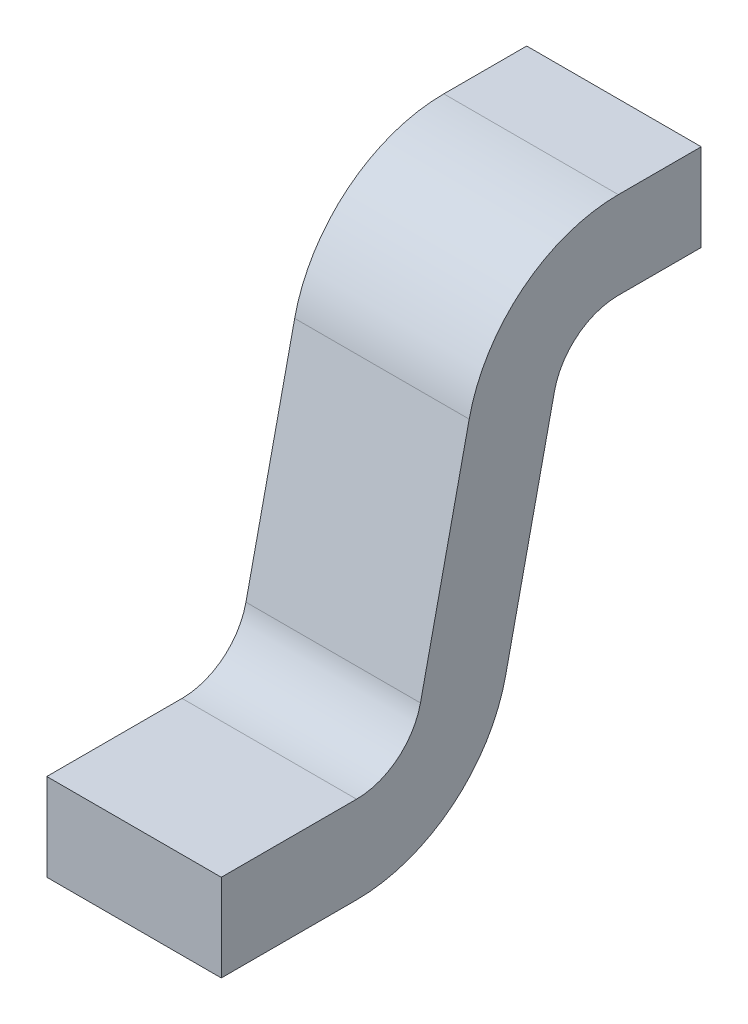
ISO-10303-21;
HEADER;
FILE_DESCRIPTION(('STEP AP214'),'2;1');
FILE_NAME('part.step','',(''),(''),'','','');
FILE_SCHEMA(('AUTOMOTIVE_DESIGN { 1 0 10303 214 1 1 1 1 }'));
ENDSEC;
DATA;
#1=APPLICATION_CONTEXT('core data for automotive mechanical design processes');
#2=APPLICATION_PROTOCOL_DEFINITION('international standard','automotive_design',2000,#1);
#3=PRODUCT_CONTEXT('',#1,'mechanical');
#4=PRODUCT('Part','Part','',(#3));
#5=PRODUCT_RELATED_PRODUCT_CATEGORY('part','',(#4));
#6=PRODUCT_DEFINITION_FORMATION('','',#4);
#7=PRODUCT_DEFINITION_CONTEXT('part definition',#1,'design');
#8=PRODUCT_DEFINITION('design','',#6,#7);
#9=PRODUCT_DEFINITION_SHAPE('','',#8);
#10=(LENGTH_UNIT() NAMED_UNIT(*) SI_UNIT(.MILLI.,.METRE.));
#11=(NAMED_UNIT(*) PLANE_ANGLE_UNIT() SI_UNIT($,.RADIAN.));
#12=(NAMED_UNIT(*) SI_UNIT($,.STERADIAN.) SOLID_ANGLE_UNIT());
#13=UNCERTAINTY_MEASURE_WITH_UNIT(LENGTH_MEASURE(1.E-05),#10,'distance_accuracy_value','');
#14=(GEOMETRIC_REPRESENTATION_CONTEXT(3) GLOBAL_UNCERTAINTY_ASSIGNED_CONTEXT((#13)) GLOBAL_UNIT_ASSIGNED_CONTEXT((#10,
#11,#12)) REPRESENTATION_CONTEXT('',''));
#15=CARTESIAN_POINT('',(0.,0.,0.));
#16=DIRECTION('',(0.,0.,1.));
#17=DIRECTION('',(1.,0.,0.));
#18=AXIS2_PLACEMENT_3D('',#15,#16,#17);
#19=CARTESIAN_POINT('',(-0.2,-0.25,0.19));
#20=DIRECTION('',(1.,0.,0.));
#21=DIRECTION('',(0.,0.,-1.));
#22=AXIS2_PLACEMENT_3D('',#19,#20,#21);
#23=PLANE('',#22);
#24=DIRECTION('',(0.,0.976627109439069,-0.214940664158015));
#25=VECTOR('',#24,1.);
#26=CARTESIAN_POINT('',(-0.2,-0.217758900376,0.336494066416));
#27=LINE('',#26,#25);
#28=CARTESIAN_POINT('',(-0.2,-0.725229232455129,0.448180511696269));
#29=VERTEX_POINT('',#28);
#30=CARTESIAN_POINT('',(-0.2,-0.217758900376149,0.33649406641593));
#31=VERTEX_POINT('',#30);
#32=EDGE_CURVE('E96',#29,#31,#27,.T.);
#33=ORIENTED_EDGE('',*,*,#32,.F.);
#34=CARTESIAN_POINT('',(-0.2,-0.65,0.79));
#35=DIRECTION('',(1.,0.,0.));
#36=DIRECTION('',(0.,0.,-1.));
#37=AXIS2_PLACEMENT_3D('',#34,#35,#36);
#38=CIRCLE('',#37,0.35);
#39=CARTESIAN_POINT('',(-0.2,-1.,0.79));
#40=VERTEX_POINT('',#39);
#41=EDGE_CURVE('E165',#40,#29,#38,.T.);
#42=ORIENTED_EDGE('',*,*,#41,.F.);
#43=DIRECTION('',(0.,0.,-1.));
#44=VECTOR('',#43,1.);
#45=CARTESIAN_POINT('',(-0.2,-1.,1.1));
#46=LINE('',#45,#44);
#47=CARTESIAN_POINT('',(-0.2,-1.,1.1));
#48=VERTEX_POINT('',#47);
#49=EDGE_CURVE('E118',#48,#40,#46,.T.);
#50=ORIENTED_EDGE('',*,*,#49,.F.);
#51=DIRECTION('',(0.,1.,0.));
#52=VECTOR('',#51,1.);
#53=CARTESIAN_POINT('',(-0.2,-1.,1.1));
#54=LINE('',#53,#52);
#55=CARTESIAN_POINT('',(-0.2,-0.8,1.1));
#56=VERTEX_POINT('',#55);
#57=EDGE_CURVE('E123',#48,#56,#54,.T.);
#58=ORIENTED_EDGE('',*,*,#57,.T.);
#59=DIRECTION('',(0.,0.,-1.));
#60=VECTOR('',#59,1.);
#61=CARTESIAN_POINT('',(-0.2,-0.8,1.1));
#62=LINE('',#61,#60);
#63=CARTESIAN_POINT('',(-0.2,-0.8,0.79));
#64=VERTEX_POINT('',#63);
#65=EDGE_CURVE('E130',#56,#64,#62,.T.);
#66=ORIENTED_EDGE('',*,*,#65,.T.);
#67=CARTESIAN_POINT('',(-0.2,-0.65,0.79));
#68=DIRECTION('',(1.,0.,0.));
#69=DIRECTION('',(0.,0.,-1.));
#70=AXIS2_PLACEMENT_3D('',#67,#68,#69);
#71=CIRCLE('',#70,0.15);
#72=CARTESIAN_POINT('',(-0.2,-0.682241099623828,0.643505933584176));
#73=VERTEX_POINT('',#72);
#74=EDGE_CURVE('E167',#64,#73,#71,.T.);
#75=ORIENTED_EDGE('',*,*,#74,.T.);
#76=DIRECTION('',(0.,0.976627109439069,-0.214940664158015));
#77=VECTOR('',#76,1.);
#78=CARTESIAN_POINT('',(-0.2,-0.174770767545,0.531819488304));
#79=LINE('',#78,#77);
#80=CARTESIAN_POINT('',(-0.2,-0.17477076754482,0.531819488303961));
#81=VERTEX_POINT('',#80);
#82=EDGE_CURVE('E135',#73,#81,#79,.T.);
#83=ORIENTED_EDGE('',*,*,#82,.T.);
#84=CARTESIAN_POINT('',(-0.2,-0.25,0.19));
#85=DIRECTION('',(1.,0.,0.));
#86=DIRECTION('',(0.,0.,-1.));
#87=AXIS2_PLACEMENT_3D('',#84,#85,#86);
#88=CIRCLE('',#87,0.35);
#89=CARTESIAN_POINT('',(-0.2,0.1,0.19));
#90=VERTEX_POINT('',#89);
#91=EDGE_CURVE('E138',#90,#81,#88,.T.);
#92=ORIENTED_EDGE('',*,*,#91,.F.);
#93=DIRECTION('',(0.,0.,-1.));
#94=VECTOR('',#93,1.);
#95=CARTESIAN_POINT('',(-0.2,0.1,0.19));
#96=LINE('',#95,#94);
#97=CARTESIAN_POINT('',(-0.2,0.1,0.));
#98=VERTEX_POINT('',#97);
#99=EDGE_CURVE('E139',#90,#98,#96,.T.);
#100=ORIENTED_EDGE('',*,*,#99,.T.);
#101=DIRECTION('',(0.,1.,0.));
#102=VECTOR('',#101,1.);
#103=CARTESIAN_POINT('',(-0.2,0.1,0.));
#104=LINE('',#103,#102);
#105=CARTESIAN_POINT('',(-0.2,-0.1,0.));
#106=VERTEX_POINT('',#105);
#107=EDGE_CURVE('E146',#98,#106,#104,.F.);
#108=ORIENTED_EDGE('',*,*,#107,.T.);
#109=DIRECTION('',(0.,0.,-1.));
#110=VECTOR('',#109,1.);
#111=CARTESIAN_POINT('',(-0.2,-0.1,0.19));
#112=LINE('',#111,#110);
#113=CARTESIAN_POINT('',(-0.2,-0.1,0.19));
#114=VERTEX_POINT('',#113);
#115=EDGE_CURVE('E99',#114,#106,#112,.T.);
#116=ORIENTED_EDGE('',*,*,#115,.F.);
#117=CARTESIAN_POINT('',(-0.2,-0.25,0.19));
#118=DIRECTION('',(1.,0.,0.));
#119=DIRECTION('',(0.,0.,-1.));
#120=AXIS2_PLACEMENT_3D('',#117,#118,#119);
#121=CIRCLE('',#120,0.15);
#122=EDGE_CURVE('E20',#114,#31,#121,.T.);
#123=ORIENTED_EDGE('',*,*,#122,.T.);
#124=EDGE_LOOP('',(#33,#42,#50,#58,#66,#75,#83,#92,#100,#108,#116,#123));
#125=FACE_BOUND('',#124,.T.);
#126=ADVANCED_FACE('F17',(#125),#23,.F.);
#127=CARTESIAN_POINT('',(-0.2,-0.217758900376,0.336494066416));
#128=DIRECTION('',(0.,-0.214940664158015,-0.976627109439069));
#129=DIRECTION('',(0.,0.976627109439069,-0.214940664158015));
#130=AXIS2_PLACEMENT_3D('',#127,#128,#129);
#131=PLANE('',#130);
#132=DIRECTION('',(1.,0.,0.));
#133=VECTOR('',#132,1.);
#134=CARTESIAN_POINT('',(-0.2,-0.217758900376043,0.336494066415804));
#135=LINE('',#134,#133);
#136=CARTESIAN_POINT('',(0.2,-0.21775890037618,0.336494066415937));
#137=VERTEX_POINT('',#136);
#138=EDGE_CURVE('E101',#31,#137,#135,.T.);
#139=ORIENTED_EDGE('',*,*,#138,.T.);
#140=DIRECTION('',(0.,0.976627109439159,-0.214940664157606));
#141=VECTOR('',#140,1.);
#142=CARTESIAN_POINT('',(0.2,-0.725229232455,0.448180511696));
#143=LINE('',#142,#141);
#144=CARTESIAN_POINT('',(0.2,-0.725229232455081,0.448180511696147));
#145=VERTEX_POINT('',#144);
#146=EDGE_CURVE('E164',#145,#137,#143,.T.);
#147=ORIENTED_EDGE('',*,*,#146,.F.);
#148=DIRECTION('',(1.,0.,0.));
#149=VECTOR('',#148,1.);
#150=CARTESIAN_POINT('',(-0.2,-0.725229232454946,0.448180511696247));
#151=LINE('',#150,#149);
#152=EDGE_CURVE('E106',#29,#145,#151,.T.);
#153=ORIENTED_EDGE('',*,*,#152,.F.);
#154=ORIENTED_EDGE('',*,*,#32,.T.);
#155=EDGE_LOOP('',(#139,#147,#153,#154));
#156=FACE_BOUND('',#155,.T.);
#157=ADVANCED_FACE('F103',(#156),#131,.T.);
#158=CARTESIAN_POINT('',(-0.2,-0.25,0.19));
#159=DIRECTION('',(1.,0.,0.));
#160=DIRECTION('',(0.,0.,-1.));
#161=AXIS2_PLACEMENT_3D('',#158,#159,#160);
#162=CYLINDRICAL_SURFACE('',#161,0.15);
#163=ORIENTED_EDGE('',*,*,#122,.F.);
#164=DIRECTION('',(1.,0.,0.));
#165=VECTOR('',#164,1.);
#166=CARTESIAN_POINT('',(-0.2,-0.1,0.19));
#167=LINE('',#166,#165);
#168=CARTESIAN_POINT('',(0.2,-0.1,0.19));
#169=VERTEX_POINT('',#168);
#170=EDGE_CURVE('E113',#169,#114,#167,.F.);
#171=ORIENTED_EDGE('',*,*,#170,.F.);
#172=CARTESIAN_POINT('',(0.2,-0.25,0.19));
#173=DIRECTION('',(1.,0.,0.));
#174=DIRECTION('',(0.,0.,-1.));
#175=AXIS2_PLACEMENT_3D('',#172,#173,#174);
#176=CIRCLE('',#175,0.15);
#177=EDGE_CURVE('E111',#137,#169,#176,.F.);
#178=ORIENTED_EDGE('',*,*,#177,.F.);
#179=ORIENTED_EDGE('',*,*,#138,.F.);
#180=EDGE_LOOP('',(#163,#171,#178,#179));
#181=FACE_BOUND('',#180,.T.);
#182=ADVANCED_FACE('F109',(#181),#162,.F.);
#183=CARTESIAN_POINT('',(-0.2,-0.1,0.19));
#184=DIRECTION('',(0.,-1.,0.));
#185=DIRECTION('',(0.,0.,-1.));
#186=AXIS2_PLACEMENT_3D('',#183,#184,#185);
#187=PLANE('',#186);
#188=DIRECTION('',(1.,0.,0.));
#189=VECTOR('',#188,1.);
#190=CARTESIAN_POINT('',(-0.2,-0.1,0.));
#191=LINE('',#190,#189);
#192=CARTESIAN_POINT('',(0.2,-0.1,0.));
#193=VERTEX_POINT('',#192);
#194=EDGE_CURVE('E143',#106,#193,#191,.T.);
#195=ORIENTED_EDGE('',*,*,#194,.T.);
#196=DIRECTION('',(0.,0.,-1.));
#197=VECTOR('',#196,1.);
#198=CARTESIAN_POINT('',(0.2,-0.1,0.19));
#199=LINE('',#198,#197);
#200=EDGE_CURVE('E163',#169,#193,#199,.T.);
#201=ORIENTED_EDGE('',*,*,#200,.F.);
#202=ORIENTED_EDGE('',*,*,#170,.T.);
#203=ORIENTED_EDGE('',*,*,#115,.T.);
#204=EDGE_LOOP('',(#195,#201,#202,#203));
#205=FACE_BOUND('',#204,.T.);
#206=ADVANCED_FACE('F194',(#205),#187,.T.);
#207=CARTESIAN_POINT('',(-0.2,0.1,0.));
#208=DIRECTION('',(0.,0.,1.));
#209=DIRECTION('',(1.,0.,0.));
#210=AXIS2_PLACEMENT_3D('',#207,#208,#209);
#211=PLANE('',#210);
#212=ORIENTED_EDGE('',*,*,#194,.F.);
#213=ORIENTED_EDGE('',*,*,#107,.F.);
#214=DIRECTION('',(1.,0.,0.));
#215=VECTOR('',#214,1.);
#216=CARTESIAN_POINT('',(-0.2,0.1,0.));
#217=LINE('',#216,#215);
#218=CARTESIAN_POINT('',(0.2,0.1,0.));
#219=VERTEX_POINT('',#218);
#220=EDGE_CURVE('E142',#98,#219,#217,.T.);
#221=ORIENTED_EDGE('',*,*,#220,.T.);
#222=DIRECTION('',(0.,1.,0.));
#223=VECTOR('',#222,1.);
#224=CARTESIAN_POINT('',(0.2,-0.25,0.));
#225=LINE('',#224,#223);
#226=EDGE_CURVE('E183',#193,#219,#225,.T.);
#227=ORIENTED_EDGE('',*,*,#226,.F.);
#228=EDGE_LOOP('',(#212,#213,#221,#227));
#229=FACE_BOUND('',#228,.T.);
#230=ADVANCED_FACE('F199',(#229),#211,.F.);
#231=CARTESIAN_POINT('',(-0.2,0.1,0.19));
#232=DIRECTION('',(0.,-1.,0.));
#233=DIRECTION('',(0.,0.,-1.));
#234=AXIS2_PLACEMENT_3D('',#231,#232,#233);
#235=PLANE('',#234);
#236=ORIENTED_EDGE('',*,*,#220,.F.);
#237=ORIENTED_EDGE('',*,*,#99,.F.);
#238=DIRECTION('',(1.,0.,0.));
#239=VECTOR('',#238,1.);
#240=CARTESIAN_POINT('',(-0.2,0.1,0.19));
#241=LINE('',#240,#239);
#242=CARTESIAN_POINT('',(0.2,0.1,0.19));
#243=VERTEX_POINT('',#242);
#244=EDGE_CURVE('E169',#243,#90,#241,.F.);
#245=ORIENTED_EDGE('',*,*,#244,.F.);
#246=DIRECTION('',(0.,0.,-1.));
#247=VECTOR('',#246,1.);
#248=CARTESIAN_POINT('',(0.2,0.1,0.19));
#249=LINE('',#248,#247);
#250=EDGE_CURVE('E161',#219,#243,#249,.F.);
#251=ORIENTED_EDGE('',*,*,#250,.F.);
#252=EDGE_LOOP('',(#236,#237,#245,#251));
#253=FACE_BOUND('',#252,.T.);
#254=ADVANCED_FACE('F247',(#253),#235,.F.);
#255=CARTESIAN_POINT('',(-0.2,-0.25,0.19));
#256=DIRECTION('',(1.,0.,0.));
#257=DIRECTION('',(0.,0.,-1.));
#258=AXIS2_PLACEMENT_3D('',#255,#256,#257);
#259=CYLINDRICAL_SURFACE('',#258,0.35);
#260=DIRECTION('',(1.,0.,0.));
#261=VECTOR('',#260,1.);
#262=CARTESIAN_POINT('',(-0.2,-0.174770767545,0.531819488304));
#263=LINE('',#262,#261);
#264=CARTESIAN_POINT('',(0.2,-0.174770767544892,0.531819488303976));
#265=VERTEX_POINT('',#264);
#266=EDGE_CURVE('E137',#81,#265,#263,.T.);
#267=ORIENTED_EDGE('',*,*,#266,.T.);
#268=CARTESIAN_POINT('',(0.2,-0.25,0.19));
#269=DIRECTION('',(1.,0.,0.));
#270=DIRECTION('',(0.,0.,-1.));
#271=AXIS2_PLACEMENT_3D('',#268,#269,#270);
#272=CIRCLE('',#271,0.35);
#273=EDGE_CURVE('E158',#243,#265,#272,.T.);
#274=ORIENTED_EDGE('',*,*,#273,.F.);
#275=ORIENTED_EDGE('',*,*,#244,.T.);
#276=ORIENTED_EDGE('',*,*,#91,.T.);
#277=EDGE_LOOP('',(#267,#274,#275,#276));
#278=FACE_BOUND('',#277,.T.);
#279=ADVANCED_FACE('F284',(#278),#259,.T.);
#280=CARTESIAN_POINT('',(-0.2,-0.174770767545,0.531819488304));
#281=DIRECTION('',(0.,-0.214940664158015,-0.976627109439069));
#282=DIRECTION('',(0.,0.976627109439069,-0.214940664158015));
#283=AXIS2_PLACEMENT_3D('',#280,#281,#282);
#284=PLANE('',#283);
#285=ORIENTED_EDGE('',*,*,#266,.F.);
#286=ORIENTED_EDGE('',*,*,#82,.F.);
#287=DIRECTION('',(1.,0.,0.));
#288=VECTOR('',#287,1.);
#289=CARTESIAN_POINT('',(-0.2,-0.682241099623957,0.643505933584196));
#290=LINE('',#289,#288);
#291=CARTESIAN_POINT('',(0.2,-0.682241099623821,0.643505933584063));
#292=VERTEX_POINT('',#291);
#293=EDGE_CURVE('E132',#73,#292,#290,.T.);
#294=ORIENTED_EDGE('',*,*,#293,.T.);
#295=DIRECTION('',(0.,-0.976627109439159,0.214940664157606));
#296=VECTOR('',#295,1.);
#297=CARTESIAN_POINT('',(0.2,-0.174770767545,0.531819488304));
#298=LINE('',#297,#296);
#299=EDGE_CURVE('E157',#265,#292,#298,.T.);
#300=ORIENTED_EDGE('',*,*,#299,.F.);
#301=EDGE_LOOP('',(#285,#286,#294,#300));
#302=FACE_BOUND('',#301,.T.);
#303=ADVANCED_FACE('F234',(#302),#284,.F.);
#304=CARTESIAN_POINT('',(-0.2,-0.65,0.79));
#305=DIRECTION('',(1.,0.,0.));
#306=DIRECTION('',(0.,0.,-1.));
#307=AXIS2_PLACEMENT_3D('',#304,#305,#306);
#308=CYLINDRICAL_SURFACE('',#307,0.15);
#309=ORIENTED_EDGE('',*,*,#74,.F.);
#310=DIRECTION('',(1.,0.,0.));
#311=VECTOR('',#310,1.);
#312=CARTESIAN_POINT('',(-0.2,-0.8,0.79));
#313=LINE('',#312,#311);
#314=CARTESIAN_POINT('',(0.2,-0.8,0.79));
#315=VERTEX_POINT('',#314);
#316=EDGE_CURVE('E127',#64,#315,#313,.T.);
#317=ORIENTED_EDGE('',*,*,#316,.T.);
#318=CARTESIAN_POINT('',(0.2,-0.65,0.79));
#319=DIRECTION('',(1.,0.,0.));
#320=DIRECTION('',(0.,0.,-1.));
#321=AXIS2_PLACEMENT_3D('',#318,#319,#320);
#322=CIRCLE('',#321,0.15);
#323=EDGE_CURVE('E153',#292,#315,#322,.F.);
#324=ORIENTED_EDGE('',*,*,#323,.F.);
#325=ORIENTED_EDGE('',*,*,#293,.F.);
#326=EDGE_LOOP('',(#309,#317,#324,#325));
#327=FACE_BOUND('',#326,.T.);
#328=ADVANCED_FACE('F238',(#327),#308,.F.);
#329=CARTESIAN_POINT('',(-0.2,-0.8,1.1));
#330=DIRECTION('',(0.,-1.,0.));
#331=DIRECTION('',(0.,0.,-1.));
#332=AXIS2_PLACEMENT_3D('',#329,#330,#331);
#333=PLANE('',#332);
#334=ORIENTED_EDGE('',*,*,#316,.F.);
#335=ORIENTED_EDGE('',*,*,#65,.F.);
#336=DIRECTION('',(-1.,0.,0.));
#337=VECTOR('',#336,1.);
#338=CARTESIAN_POINT('',(-0.2,-0.8,1.1));
#339=LINE('',#338,#337);
#340=CARTESIAN_POINT('',(0.2,-0.8,1.1));
#341=VERTEX_POINT('',#340);
#342=EDGE_CURVE('E126',#56,#341,#339,.F.);
#343=ORIENTED_EDGE('',*,*,#342,.T.);
#344=DIRECTION('',(0.,0.,-1.));
#345=VECTOR('',#344,1.);
#346=CARTESIAN_POINT('',(0.2,-0.8,0.19));
#347=LINE('',#346,#345);
#348=EDGE_CURVE('E156',#315,#341,#347,.F.);
#349=ORIENTED_EDGE('',*,*,#348,.F.);
#350=EDGE_LOOP('',(#334,#335,#343,#349));
#351=FACE_BOUND('',#350,.T.);
#352=ADVANCED_FACE('F253',(#351),#333,.F.);
#353=CARTESIAN_POINT('',(-0.2,-1.,1.1));
#354=DIRECTION('',(0.,0.,-1.));
#355=DIRECTION('',(-1.,0.,0.));
#356=AXIS2_PLACEMENT_3D('',#353,#354,#355);
#357=PLANE('',#356);
#358=ORIENTED_EDGE('',*,*,#342,.F.);
#359=ORIENTED_EDGE('',*,*,#57,.F.);
#360=DIRECTION('',(1.,0.,0.));
#361=VECTOR('',#360,1.);
#362=CARTESIAN_POINT('',(-0.2,-1.,1.1));
#363=LINE('',#362,#361);
#364=CARTESIAN_POINT('',(0.2,-1.,1.1));
#365=VERTEX_POINT('',#364);
#366=EDGE_CURVE('E120',#365,#48,#363,.F.);
#367=ORIENTED_EDGE('',*,*,#366,.F.);
#368=DIRECTION('',(0.,1.,0.));
#369=VECTOR('',#368,1.);
#370=CARTESIAN_POINT('',(0.2,-0.25,1.1));
#371=LINE('',#370,#369);
#372=EDGE_CURVE('E220',#341,#365,#371,.F.);
#373=ORIENTED_EDGE('',*,*,#372,.F.);
#374=EDGE_LOOP('',(#358,#359,#367,#373));
#375=FACE_BOUND('',#374,.T.);
#376=ADVANCED_FACE('F263',(#375),#357,.F.);
#377=CARTESIAN_POINT('',(-0.2,-1.,1.1));
#378=DIRECTION('',(0.,-1.,0.));
#379=DIRECTION('',(0.,0.,-1.));
#380=AXIS2_PLACEMENT_3D('',#377,#378,#379);
#381=PLANE('',#380);
#382=DIRECTION('',(1.,0.,0.));
#383=VECTOR('',#382,1.);
#384=CARTESIAN_POINT('',(-0.2,-1.,0.79));
#385=LINE('',#384,#383);
#386=CARTESIAN_POINT('',(0.2,-1.,0.79));
#387=VERTEX_POINT('',#386);
#388=EDGE_CURVE('E35',#387,#40,#385,.F.);
#389=ORIENTED_EDGE('',*,*,#388,.F.);
#390=DIRECTION('',(0.,0.,-1.));
#391=VECTOR('',#390,1.);
#392=CARTESIAN_POINT('',(0.2,-1.,0.19));
#393=LINE('',#392,#391);
#394=EDGE_CURVE('E26',#365,#387,#393,.T.);
#395=ORIENTED_EDGE('',*,*,#394,.F.);
#396=ORIENTED_EDGE('',*,*,#366,.T.);
#397=ORIENTED_EDGE('',*,*,#49,.T.);
#398=EDGE_LOOP('',(#389,#395,#396,#397));
#399=FACE_BOUND('',#398,.T.);
#400=ADVANCED_FACE('F259',(#399),#381,.T.);
#401=CARTESIAN_POINT('',(-0.2,-0.65,0.79));
#402=DIRECTION('',(1.,0.,0.));
#403=DIRECTION('',(0.,0.,-1.));
#404=AXIS2_PLACEMENT_3D('',#401,#402,#403);
#405=CYLINDRICAL_SURFACE('',#404,0.35);
#406=ORIENTED_EDGE('',*,*,#152,.T.);
#407=CARTESIAN_POINT('',(0.2,-0.65,0.79));
#408=DIRECTION('',(1.,0.,0.));
#409=DIRECTION('',(0.,0.,-1.));
#410=AXIS2_PLACEMENT_3D('',#407,#408,#409);
#411=CIRCLE('',#410,0.35);
#412=EDGE_CURVE('E11',#387,#145,#411,.T.);
#413=ORIENTED_EDGE('',*,*,#412,.F.);
#414=ORIENTED_EDGE('',*,*,#388,.T.);
#415=ORIENTED_EDGE('',*,*,#41,.T.);
#416=EDGE_LOOP('',(#406,#413,#414,#415));
#417=FACE_BOUND('',#416,.T.);
#418=ADVANCED_FACE('F265',(#417),#405,.T.);
#419=CARTESIAN_POINT('',(0.2,-0.25,0.19));
#420=DIRECTION('',(1.,0.,0.));
#421=DIRECTION('',(0.,0.,-1.));
#422=AXIS2_PLACEMENT_3D('',#419,#420,#421);
#423=PLANE('',#422);
#424=ORIENTED_EDGE('',*,*,#394,.T.);
#425=ORIENTED_EDGE('',*,*,#412,.T.);
#426=ORIENTED_EDGE('',*,*,#146,.T.);
#427=ORIENTED_EDGE('',*,*,#177,.T.);
#428=ORIENTED_EDGE('',*,*,#200,.T.);
#429=ORIENTED_EDGE('',*,*,#226,.T.);
#430=ORIENTED_EDGE('',*,*,#250,.T.);
#431=ORIENTED_EDGE('',*,*,#273,.T.);
#432=ORIENTED_EDGE('',*,*,#299,.T.);
#433=ORIENTED_EDGE('',*,*,#323,.T.);
#434=ORIENTED_EDGE('',*,*,#348,.T.);
#435=ORIENTED_EDGE('',*,*,#372,.T.);
#436=EDGE_LOOP('',(#424,#425,#426,#427,#428,#429,#430,#431,#432,#433,#434,#435));
#437=FACE_BOUND('',#436,.T.);
#438=ADVANCED_FACE('F205',(#437),#423,.T.);
#439=CLOSED_SHELL('',(#126,#157,#182,#206,#230,#254,#279,#303,#328,#352,#376,#400,#418,#438));
#440=MANIFOLD_SOLID_BREP('B1',#439);
#441=ADVANCED_BREP_SHAPE_REPRESENTATION('',(#18,#440),#14);
#442=SHAPE_DEFINITION_REPRESENTATION(#9,#441);
ENDSEC;
END-ISO-10303-21;
